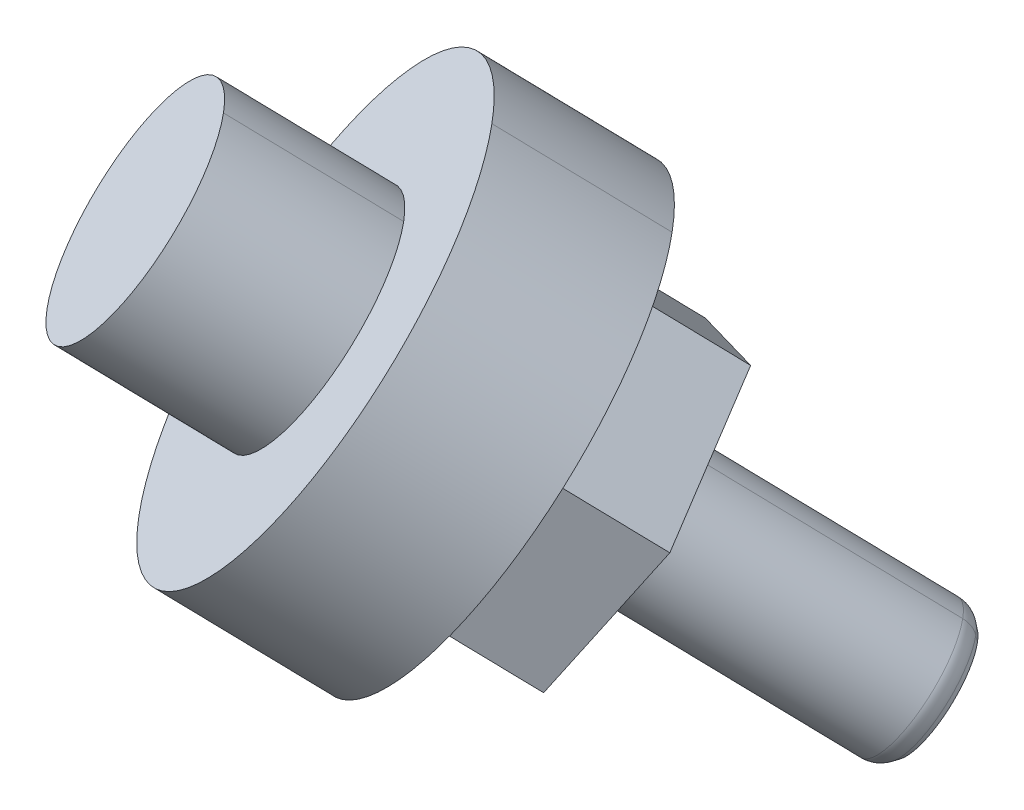
ISO-10303-21;
HEADER;
FILE_DESCRIPTION(('STEP AP214'),'2;1');
FILE_NAME('part.step','',(''),(''),'','','');
FILE_SCHEMA(('AUTOMOTIVE_DESIGN { 1 0 10303 214 1 1 1 1 }'));
ENDSEC;
DATA;
#1=APPLICATION_CONTEXT('core data for automotive mechanical design processes');
#2=APPLICATION_PROTOCOL_DEFINITION('international standard','automotive_design',2000,#1);
#3=PRODUCT_CONTEXT('',#1,'mechanical');
#4=PRODUCT('Part','Part','',(#3));
#5=PRODUCT_RELATED_PRODUCT_CATEGORY('part','',(#4));
#6=PRODUCT_DEFINITION_FORMATION('','',#4);
#7=PRODUCT_DEFINITION_CONTEXT('part definition',#1,'design');
#8=PRODUCT_DEFINITION('design','',#6,#7);
#9=PRODUCT_DEFINITION_SHAPE('','',#8);
#10=(LENGTH_UNIT() NAMED_UNIT(*) SI_UNIT(.MILLI.,.METRE.));
#11=(NAMED_UNIT(*) PLANE_ANGLE_UNIT() SI_UNIT($,.RADIAN.));
#12=(NAMED_UNIT(*) SI_UNIT($,.STERADIAN.) SOLID_ANGLE_UNIT());
#13=UNCERTAINTY_MEASURE_WITH_UNIT(LENGTH_MEASURE(1.E-05),#10,'distance_accuracy_value','');
#14=(GEOMETRIC_REPRESENTATION_CONTEXT(3) GLOBAL_UNCERTAINTY_ASSIGNED_CONTEXT((#13)) GLOBAL_UNIT_ASSIGNED_CONTEXT((#10,
#11,#12)) REPRESENTATION_CONTEXT('',''));
#15=CARTESIAN_POINT('',(0.,0.,0.));
#16=DIRECTION('',(0.,0.,1.));
#17=DIRECTION('',(1.,0.,0.));
#18=AXIS2_PLACEMENT_3D('',#15,#16,#17);
#19=CARTESIAN_POINT('',(10.8878978755803,142.293178335377,-127.729289276092));
#20=DIRECTION('',(0.61920209785537,-0.567677192432231,-0.542523149002666));
#21=DIRECTION('',(0.456004118234116,0.822428391633827,-0.340105549481515));
#22=AXIS2_PLACEMENT_3D('',#19,#20,#21);
#23=PLANE('',#22);
#24=CARTESIAN_POINT('',(10.8878978755803,142.293178335377,-127.729289276092));
#25=DIRECTION('',(0.61920209785537,-0.567677192432231,-0.542523149002666));
#26=DIRECTION('',(-0.596988629335281,0.108485304213333,-0.794880818245177));
#27=AXIS2_PLACEMENT_3D('',#24,#25,#26);
#28=CIRCLE('',#27,10.0000000003);
#29=CARTESIAN_POINT('',(4.91801158228085,143.378031377943,-135.678097458963));
#30=VERTEX_POINT('',#29);
#31=CARTESIAN_POINT('',(15.4479390580716,150.517462252076,-131.130344770909));
#32=VERTEX_POINT('',#31);
#33=EDGE_CURVE('E11',#30,#32,#28,.T.);
#34=ORIENTED_EDGE('',*,*,#33,.T.);
#35=CARTESIAN_POINT('',(10.8878978755803,142.293178335377,-127.729289276092));
#36=DIRECTION('',(0.61920209785537,-0.567677192432231,-0.542523149002666));
#37=DIRECTION('',(-0.596988629335281,0.108485304213333,-0.794880818245177));
#38=AXIS2_PLACEMENT_3D('',#35,#36,#37);
#39=CIRCLE('',#38,10.0000000003);
#40=CARTESIAN_POINT('',(16.8577841688587,141.208325292647,-119.780481093335));
#41=VERTEX_POINT('',#40);
#42=EDGE_CURVE('E27',#32,#41,#39,.T.);
#43=ORIENTED_EDGE('',*,*,#42,.T.);
#44=CARTESIAN_POINT('',(10.8878978755803,142.293178335377,-127.729289276092));
#45=DIRECTION('',(0.61920209785537,-0.567677192432231,-0.542523149002666));
#46=DIRECTION('',(-0.596988629335281,0.108485304213333,-0.794880818245177));
#47=AXIS2_PLACEMENT_3D('',#44,#45,#46);
#48=CIRCLE('',#47,10.0000000003);
#49=CARTESIAN_POINT('',(6.32785669309949,134.068894418759,-124.328233781217));
#50=VERTEX_POINT('',#49);
#51=EDGE_CURVE('E340',#41,#50,#48,.T.);
#52=ORIENTED_EDGE('',*,*,#51,.T.);
#53=CARTESIAN_POINT('',(10.8878978755803,142.293178335377,-127.729289276092));
#54=DIRECTION('',(0.61920209785537,-0.567677192432231,-0.542523149002666));
#55=DIRECTION('',(-0.596988629335281,0.108485304213333,-0.794880818245177));
#56=AXIS2_PLACEMENT_3D('',#53,#54,#55);
#57=CIRCLE('',#56,10.0000000003);
#58=EDGE_CURVE('E337',#50,#30,#57,.T.);
#59=ORIENTED_EDGE('',*,*,#58,.T.);
#60=EDGE_LOOP('',(#34,#43,#52,#59));
#61=FACE_BOUND('',#60,.T.);
#62=DIRECTION('',(-0.781614517984955,-0.379345568993508,-0.495152183232729));
#63=VECTOR('',#62,1.);
#64=CARTESIAN_POINT('',(11.3543618797028,146.820355218604,-131.933975429617));
#65=LINE('',#64,#63);
#66=CARTESIAN_POINT('',(14.1504707857522,148.177407191682,-130.162642633904));
#67=VERTEX_POINT('',#66);
#68=CARTESIAN_POINT('',(8.55825297354791,145.463303244714,-133.705308225904));
#69=VERTEX_POINT('',#68);
#70=EDGE_CURVE('E334',#67,#69,#65,.T.);
#71=ORIENTED_EDGE('',*,*,#70,.T.);
#72=DIRECTION('',(-0.456004118233701,-0.822428391634207,0.340105549481152));
#73=VECTOR('',#72,1.);
#74=CARTESIAN_POINT('',(6.92696651808229,142.521188816152,-132.488631546349));
#75=LINE('',#74,#73);
#76=CARTESIAN_POINT('',(5.29568006262894,139.579074387309,-131.271954867095));
#77=VERTEX_POINT('',#76);
#78=EDGE_CURVE('E331',#69,#77,#75,.T.);
#79=ORIENTED_EDGE('',*,*,#78,.T.);
#80=DIRECTION('',(0.3256103998447,-0.443082822472481,0.835257732644717));
#81=VECTOR('',#80,1.);
#82=CARTESIAN_POINT('',(6.46050251400198,137.99401193325,-128.283945392594));
#83=LINE('',#82,#81);
#84=CARTESIAN_POINT('',(7.62532496550214,136.408949479114,-125.295935918182));
#85=VERTEX_POINT('',#84);
#86=EDGE_CURVE('E328',#77,#85,#83,.T.);
#87=ORIENTED_EDGE('',*,*,#86,.T.);
#88=DIRECTION('',(0.781614517984955,0.379345568993508,0.495152183232729));
#89=VECTOR('',#88,1.);
#90=CARTESIAN_POINT('',(10.421433871541,137.766001452111,-123.524603122527));
#91=LINE('',#90,#89);
#92=CARTESIAN_POINT('',(13.2175427775905,139.123053425189,-121.753270326814));
#93=VERTEX_POINT('',#92);
#94=EDGE_CURVE('E325',#85,#93,#91,.T.);
#95=ORIENTED_EDGE('',*,*,#94,.T.);
#96=DIRECTION('',(0.456004118233701,0.822428391634207,-0.340105549481152));
#97=VECTOR('',#96,1.);
#98=CARTESIAN_POINT('',(14.8488292331071,142.065167854519,-122.969947005723));
#99=LINE('',#98,#97);
#100=CARTESIAN_POINT('',(16.4801156885727,145.007282283081,-124.186623685278));
#101=VERTEX_POINT('',#100);
#102=EDGE_CURVE('E322',#93,#101,#99,.T.);
#103=ORIENTED_EDGE('',*,*,#102,.T.);
#104=DIRECTION('',(-0.3256103998447,0.443082822472481,-0.835257732644717));
#105=VECTOR('',#104,1.);
#106=CARTESIAN_POINT('',(15.3152932371463,146.592344737785,-127.174633159288));
#107=LINE('',#106,#105);
#108=EDGE_CURVE('E320',#101,#67,#107,.T.);
#109=ORIENTED_EDGE('',*,*,#108,.T.);
#110=EDGE_LOOP('',(#71,#79,#87,#95,#103,#109));
#111=FACE_BOUND('',#110,.T.);
#112=ADVANCED_FACE('F17',(#61,#111),#23,.T.);
#113=CARTESIAN_POINT('',(6.55348319054595,146.266918682153,-123.931627233247));
#114=DIRECTION('',(0.61920209785537,-0.567677192432231,-0.542523149002666));
#115=DIRECTION('',(0.732561464118193,0.16884330956625,0.659428266078825));
#116=AXIS2_PLACEMENT_3D('',#113,#114,#115);
#117=CYLINDRICAL_SURFACE('',#116,10.);
#118=DIRECTION('',(0.61920209785537,-0.567677192432231,-0.542523149002666));
#119=VECTOR('',#118,1.);
#120=CARTESIAN_POINT('',(11.1135243724836,154.491202599041,-127.332682728231));
#121=LINE('',#120,#119);
#122=CARTESIAN_POINT('',(11.1135243729571,154.491202598682,-127.33268272781));
#123=VERTEX_POINT('',#122);
#124=EDGE_CURVE('E317',#123,#32,#121,.T.);
#125=ORIENTED_EDGE('',*,*,#124,.T.);
#126=ORIENTED_EDGE('',*,*,#33,.F.);
#127=ORIENTED_EDGE('',*,*,#58,.F.);
#128=DIRECTION('',(-0.61920209785537,0.567677192432231,0.542523149002666));
#129=VECTOR('',#128,1.);
#130=CARTESIAN_POINT('',(1.99344200824018,138.042634766436,-120.53057173811));
#131=LINE('',#130,#129);
#132=CARTESIAN_POINT('',(1.99344200826894,138.042634766354,-120.530571737999));
#133=VERTEX_POINT('',#132);
#134=EDGE_CURVE('E314',#50,#133,#131,.T.);
#135=ORIENTED_EDGE('',*,*,#134,.T.);
#136=CARTESIAN_POINT('',(6.55348319054595,146.266918682153,-123.931627233247));
#137=DIRECTION('',(0.61920209785537,-0.567677192432231,-0.542523149002666));
#138=DIRECTION('',(-0.59698862933528,0.108485304213335,-0.794880818245178));
#139=AXIS2_PLACEMENT_3D('',#136,#137,#138);
#140=CIRCLE('',#139,10.);
#141=CARTESIAN_POINT('',(0.583596897244921,147.351771724548,-131.880435415527));
#142=VERTEX_POINT('',#141);
#143=EDGE_CURVE('E312',#133,#142,#140,.T.);
#144=ORIENTED_EDGE('',*,*,#143,.T.);
#145=CARTESIAN_POINT('',(6.55348319054595,146.266918682153,-123.931627233247));
#146=DIRECTION('',(0.61920209785537,-0.567677192432231,-0.542523149002666));
#147=DIRECTION('',(-0.59698862933528,0.108485304213335,-0.794880818245178));
#148=AXIS2_PLACEMENT_3D('',#145,#146,#147);
#149=CIRCLE('',#148,10.);
#150=EDGE_CURVE('E310',#142,#123,#149,.T.);
#151=ORIENTED_EDGE('',*,*,#150,.T.);
#152=EDGE_LOOP('',(#125,#126,#127,#135,#144,#151));
#153=FACE_BOUND('',#152,.T.);
#154=ADVANCED_FACE('F350',(#153),#117,.T.);
#155=CARTESIAN_POINT('',(6.55348319054595,146.266918682153,-123.931627233247));
#156=DIRECTION('',(0.61920209785537,-0.567677192432231,-0.542523149002666));
#157=DIRECTION('',(0.732561464118193,0.16884330956625,0.659428266078825));
#158=AXIS2_PLACEMENT_3D('',#155,#156,#157);
#159=CYLINDRICAL_SURFACE('',#158,10.);
#160=ORIENTED_EDGE('',*,*,#134,.F.);
#161=ORIENTED_EDGE('',*,*,#51,.F.);
#162=ORIENTED_EDGE('',*,*,#42,.F.);
#163=ORIENTED_EDGE('',*,*,#124,.F.);
#164=CARTESIAN_POINT('',(6.55348319054595,146.266918682153,-123.931627233247));
#165=DIRECTION('',(0.61920209785537,-0.567677192432231,-0.542523149002666));
#166=DIRECTION('',(-0.59698862933528,0.108485304213335,-0.794880818245178));
#167=AXIS2_PLACEMENT_3D('',#164,#165,#166);
#168=CIRCLE('',#167,10.);
#169=CARTESIAN_POINT('',(12.5233694840356,145.182065640532,-115.982819050354));
#170=VERTEX_POINT('',#169);
#171=EDGE_CURVE('E308',#123,#170,#168,.T.);
#172=ORIENTED_EDGE('',*,*,#171,.T.);
#173=CARTESIAN_POINT('',(6.55348319054595,146.266918682153,-123.931627233247));
#174=DIRECTION('',(0.61920209785537,-0.567677192432231,-0.542523149002666));
#175=DIRECTION('',(-0.59698862933528,0.108485304213335,-0.794880818245178));
#176=AXIS2_PLACEMENT_3D('',#173,#174,#175);
#177=CIRCLE('',#176,10.);
#178=EDGE_CURVE('E303',#170,#133,#177,.T.);
#179=ORIENTED_EDGE('',*,*,#178,.T.);
#180=EDGE_LOOP('',(#160,#161,#162,#163,#172,#179));
#181=FACE_BOUND('',#180,.T.);
#182=ADVANCED_FACE('F347',(#181),#159,.T.);
#183=CARTESIAN_POINT('',(16.7952159227648,145.120005963361,-133.161134625099));
#184=DIRECTION('',(0.07528284846151,0.730643240174477,-0.678596307324806));
#185=DIRECTION('',(0.781614517993786,0.379345569079388,0.495152183152994));
#186=AXIS2_PLACEMENT_3D('',#183,#184,#185);
#187=PLANE('',#186);
#188=ORIENTED_EDGE('',*,*,#70,.F.);
#189=DIRECTION('',(-0.61920209785537,0.567677192432231,0.542523149002666));
#190=VECTOR('',#189,1.);
#191=CARTESIAN_POINT('',(15.6984760311261,146.758214211339,-131.518950505906));
#192=LINE('',#191,#190);
#193=CARTESIAN_POINT('',(17.2464812748745,145.339021230033,-132.875258379729));
#194=VERTEX_POINT('',#193);
#195=EDGE_CURVE('E235',#194,#67,#192,.T.);
#196=ORIENTED_EDGE('',*,*,#195,.F.);
#197=DIRECTION('',(-0.781614517993844,-0.379345569079939,-0.495152183152481));
#198=VECTOR('',#197,1.);
#199=CARTESIAN_POINT('',(14.4503723687798,143.981969256286,-134.646591174488));
#200=LINE('',#199,#198);
#201=CARTESIAN_POINT('',(11.6542634627578,142.624917282972,-136.417923970742));
#202=VERTEX_POINT('',#201);
#203=EDGE_CURVE('E300',#194,#202,#200,.T.);
#204=ORIENTED_EDGE('',*,*,#203,.T.);
#205=DIRECTION('',(-0.61920209785537,0.567677192432231,0.542523149002666));
#206=VECTOR('',#205,1.);
#207=CARTESIAN_POINT('',(10.1062582171421,144.044110262651,-135.061616098629));
#208=LINE('',#207,#206);
#209=EDGE_CURVE('E297',#202,#69,#208,.T.);
#210=ORIENTED_EDGE('',*,*,#209,.T.);
#211=EDGE_LOOP('',(#188,#196,#204,#210));
#212=FACE_BOUND('',#211,.T.);
#213=ADVANCED_FACE('F395',(#212),#187,.T.);
#214=CARTESIAN_POINT('',(11.3909893620368,142.15008802899,-136.221563939895));
#215=DIRECTION('',(-0.63925660431874,0.0367987204518855,-0.768112523012076));
#216=DIRECTION('',(0.456004118233944,0.822428391634193,-0.34010554948086));
#217=AXIS2_PLACEMENT_3D('',#214,#215,#216);
#218=PLANE('',#217);
#219=ORIENTED_EDGE('',*,*,#78,.F.);
#220=ORIENTED_EDGE('',*,*,#209,.F.);
#221=DIRECTION('',(-0.456004118233701,-0.822428391634207,0.340105549481152));
#222=VECTOR('',#221,1.);
#223=CARTESIAN_POINT('',(10.0229770072395,139.682802854004,-135.201247291474));
#224=LINE('',#223,#222);
#225=CARTESIAN_POINT('',(8.3916905517861,136.740688425161,-133.98457061222));
#226=VERTEX_POINT('',#225);
#227=EDGE_CURVE('E294',#202,#226,#224,.T.);
#228=ORIENTED_EDGE('',*,*,#227,.T.);
#229=DIRECTION('',(-0.61920209785537,0.567677192432231,0.542523149002666));
#230=VECTOR('',#229,1.);
#231=CARTESIAN_POINT('',(6.84368530715153,138.159881406295,-132.628262739733));
#232=LINE('',#231,#230);
#233=EDGE_CURVE('E291',#226,#77,#232,.T.);
#234=ORIENTED_EDGE('',*,*,#233,.T.);
#235=EDGE_LOOP('',(#219,#220,#228,#234));
#236=FACE_BOUND('',#235,.T.);
#237=ADVANCED_FACE('F398',(#236),#218,.T.);
#238=CARTESIAN_POINT('',(8.57968180415307,136.48487443898,-133.502334335691));
#239=DIRECTION('',(-0.714539452780055,-0.693844519723227,-0.0895162156864598));
#240=DIRECTION('',(-0.325610399760712,0.443082822554256,-0.835257732634079));
#241=AXIS2_PLACEMENT_3D('',#238,#239,#240);
#242=PLANE('',#241);
#243=ORIENTED_EDGE('',*,*,#86,.F.);
#244=ORIENTED_EDGE('',*,*,#233,.F.);
#245=DIRECTION('',(0.325610399760124,-0.443082822554828,0.835257732634005));
#246=VECTOR('',#245,1.);
#247=CARTESIAN_POINT('',(9.5565130034268,135.155625971356,-130.99656113778));
#248=LINE('',#247,#246);
#249=CARTESIAN_POINT('',(10.7213354549543,133.570563516432,-128.008551662431));
#250=VERTEX_POINT('',#249);
#251=EDGE_CURVE('E288',#226,#250,#248,.T.);
#252=ORIENTED_EDGE('',*,*,#251,.T.);
#253=DIRECTION('',(-0.61920209785537,0.567677192432231,0.542523149002666));
#254=VECTOR('',#253,1.);
#255=CARTESIAN_POINT('',(9.17333021025476,134.989756497441,-126.65224378993));
#256=LINE('',#255,#254);
#257=EDGE_CURVE('E285',#250,#85,#256,.T.);
#258=ORIENTED_EDGE('',*,*,#257,.T.);
#259=EDGE_LOOP('',(#243,#244,#252,#258));
#260=FACE_BOUND('',#259,.T.);
#261=ADVANCED_FACE('F402',(#260),#242,.T.);
#262=CARTESIAN_POINT('',(11.1726008070307,133.789578783223,-127.722675416876));
#263=DIRECTION('',(-0.07528284846151,-0.730643240174477,0.678596307324806));
#264=DIRECTION('',(-0.781614517993786,-0.379345569079388,-0.495152183152994));
#265=AXIS2_PLACEMENT_3D('',#262,#263,#264);
#266=PLANE('',#265);
#267=ORIENTED_EDGE('',*,*,#94,.F.);
#268=ORIENTED_EDGE('',*,*,#257,.F.);
#269=DIRECTION('',(0.781614517993844,0.379345569079939,0.495152183152481));
#270=VECTOR('',#269,1.);
#271=CARTESIAN_POINT('',(13.517444360943,134.927615490417,-126.237218867469));
#272=LINE('',#271,#270);
#273=CARTESIAN_POINT('',(16.3135532679766,136.284667464742,-124.465886071087));
#274=VERTEX_POINT('',#273);
#275=EDGE_CURVE('E282',#250,#274,#272,.T.);
#276=ORIENTED_EDGE('',*,*,#275,.T.);
#277=DIRECTION('',(-0.61920209785537,0.567677192432231,0.542523149002666));
#278=VECTOR('',#277,1.);
#279=CARTESIAN_POINT('',(14.7655480234253,137.703860445838,-123.10957819856));
#280=LINE('',#279,#278);
#281=EDGE_CURVE('E279',#274,#93,#280,.T.);
#282=ORIENTED_EDGE('',*,*,#281,.T.);
#283=EDGE_LOOP('',(#267,#268,#276,#282));
#284=FACE_BOUND('',#283,.T.);
#285=ADVANCED_FACE('F406',(#284),#266,.T.);
#286=CARTESIAN_POINT('',(16.5768273677394,136.759496717068,-124.662246102552));
#287=DIRECTION('',(0.63925660431874,-0.0367987204518855,0.768112523012076));
#288=DIRECTION('',(-0.456004118233944,-0.822428391634193,0.34010554948086));
#289=AXIS2_PLACEMENT_3D('',#286,#287,#288);
#290=PLANE('',#289);
#291=ORIENTED_EDGE('',*,*,#102,.F.);
#292=ORIENTED_EDGE('',*,*,#281,.F.);
#293=DIRECTION('',(0.456004118233701,0.822428391634207,-0.340105549481152));
#294=VECTOR('',#293,1.);
#295=CARTESIAN_POINT('',(17.9448397224307,139.226781892293,-125.68256275077));
#296=LINE('',#295,#294);
#297=CARTESIAN_POINT('',(19.5761261778418,142.168896320812,-126.899239430253));
#298=VERTEX_POINT('',#297);
#299=EDGE_CURVE('E276',#274,#298,#296,.T.);
#300=ORIENTED_EDGE('',*,*,#299,.T.);
#301=DIRECTION('',(-0.61920209785537,0.567677192432231,0.542523149002666));
#302=VECTOR('',#301,1.);
#303=CARTESIAN_POINT('',(18.0281209332905,143.588089301908,-125.542931557726));
#304=LINE('',#303,#302);
#305=EDGE_CURVE('E273',#298,#101,#304,.T.);
#306=ORIENTED_EDGE('',*,*,#305,.T.);
#307=EDGE_LOOP('',(#291,#292,#300,#306));
#308=FACE_BOUND('',#307,.T.);
#309=ADVANCED_FACE('F410',(#308),#290,.T.);
#310=CARTESIAN_POINT('',(19.3881349256003,142.424710307278,-127.381475706513));
#311=DIRECTION('',(0.714539452780055,0.693844519723227,0.0895162156864598));
#312=DIRECTION('',(0.325610399760712,-0.443082822554256,0.835257732634079));
#313=AXIS2_PLACEMENT_3D('',#310,#311,#312);
#314=PLANE('',#313);
#315=ORIENTED_EDGE('',*,*,#108,.F.);
#316=ORIENTED_EDGE('',*,*,#305,.F.);
#317=DIRECTION('',(-0.325610399760124,0.443082822554828,-0.835257732634005));
#318=VECTOR('',#317,1.);
#319=CARTESIAN_POINT('',(18.4113037263898,143.75395877539,-129.88724890408));
#320=LINE('',#319,#318);
#321=EDGE_CURVE('E270',#298,#194,#320,.T.);
#322=ORIENTED_EDGE('',*,*,#321,.T.);
#323=ORIENTED_EDGE('',*,*,#195,.T.);
#324=EDGE_LOOP('',(#315,#316,#322,#323));
#325=FACE_BOUND('',#324,.T.);
#326=ADVANCED_FACE('F358',(#325),#314,.T.);
#327=CARTESIAN_POINT('',(6.55348319054595,146.266918682153,-123.931627233247));
#328=DIRECTION('',(-0.61920209785537,0.567677192432231,0.542523149002666));
#329=DIRECTION('',(-0.456004118234116,-0.822428391633827,0.340105549481515));
#330=AXIS2_PLACEMENT_3D('',#327,#328,#329);
#331=PLANE('',#330);
#332=ORIENTED_EDGE('',*,*,#143,.F.);
#333=ORIENTED_EDGE('',*,*,#178,.F.);
#334=ORIENTED_EDGE('',*,*,#171,.F.);
#335=ORIENTED_EDGE('',*,*,#150,.F.);
#336=EDGE_LOOP('',(#332,#333,#334,#335));
#337=FACE_BOUND('',#336,.T.);
#338=CARTESIAN_POINT('',(6.55348319054595,146.266918682153,-123.931627233247));
#339=DIRECTION('',(-0.61920209785537,0.567677192432231,0.542523149002666));
#340=DIRECTION('',(-0.596988629335281,0.108485304213333,-0.794880818245177));
#341=AXIS2_PLACEMENT_3D('',#338,#339,#340);
#342=CIRCLE('',#341,5.00000000016);
#343=CARTESIAN_POINT('',(8.83350378178988,150.379060640865,-125.632154980297));
#344=VERTEX_POINT('',#343);
#345=CARTESIAN_POINT('',(3.56854004394815,146.809345203757,-127.9060313241));
#346=VERTEX_POINT('',#345);
#347=EDGE_CURVE('E228',#344,#346,#342,.T.);
#348=ORIENTED_EDGE('',*,*,#347,.F.);
#349=CARTESIAN_POINT('',(6.55348319054595,146.266918682153,-123.931627233247));
#350=DIRECTION('',(-0.61920209785537,0.567677192432231,0.542523149002666));
#351=DIRECTION('',(-0.596988629335281,0.108485304213333,-0.794880818245177));
#352=AXIS2_PLACEMENT_3D('',#349,#350,#351);
#353=CIRCLE('',#352,5.00000000016);
#354=CARTESIAN_POINT('',(9.53842633724918,145.724492161362,-119.95722314182));
#355=VERTEX_POINT('',#354);
#356=EDGE_CURVE('E216',#355,#344,#353,.T.);
#357=ORIENTED_EDGE('',*,*,#356,.F.);
#358=CARTESIAN_POINT('',(6.55348319054595,146.266918682153,-123.931627233247));
#359=DIRECTION('',(-0.61920209785537,0.567677192432231,0.542523149002666));
#360=DIRECTION('',(-0.596988629335281,0.108485304213333,-0.794880818245177));
#361=AXIS2_PLACEMENT_3D('',#358,#359,#360);
#362=CIRCLE('',#361,5.00000000016);
#363=CARTESIAN_POINT('',(4.27346259940743,142.154776724253,-122.231099485623));
#364=VERTEX_POINT('',#363);
#365=EDGE_CURVE('E265',#364,#355,#362,.T.);
#366=ORIENTED_EDGE('',*,*,#365,.F.);
#367=CARTESIAN_POINT('',(6.55348319054595,146.266918682153,-123.931627233247));
#368=DIRECTION('',(-0.61920209785537,0.567677192432231,0.542523149002666));
#369=DIRECTION('',(-0.596988629335281,0.108485304213333,-0.794880818245177));
#370=AXIS2_PLACEMENT_3D('',#367,#368,#369);
#371=CIRCLE('',#370,5.00000000016);
#372=EDGE_CURVE('E259',#346,#364,#371,.T.);
#373=ORIENTED_EDGE('',*,*,#372,.F.);
#374=EDGE_LOOP('',(#348,#357,#366,#373));
#375=FACE_BOUND('',#374,.T.);
#376=ADVANCED_FACE('F354',(#337,#375),#331,.T.);
#377=CARTESIAN_POINT('',(6.55819654754959,132.244148608914,-131.372184823122));
#378=DIRECTION('',(-0.61920209785537,0.567677192432231,0.542523149002666));
#379=DIRECTION('',(-0.456004118234116,-0.822428391633827,0.340105549481515));
#380=AXIS2_PLACEMENT_3D('',#377,#378,#379);
#381=PLANE('',#380);
#382=ORIENTED_EDGE('',*,*,#227,.F.);
#383=ORIENTED_EDGE('',*,*,#203,.F.);
#384=ORIENTED_EDGE('',*,*,#321,.F.);
#385=ORIENTED_EDGE('',*,*,#299,.F.);
#386=ORIENTED_EDGE('',*,*,#275,.F.);
#387=ORIENTED_EDGE('',*,*,#251,.F.);
#388=EDGE_LOOP('',(#382,#383,#384,#385,#386,#387));
#389=FACE_BOUND('',#388,.T.);
#390=CARTESIAN_POINT('',(12.6158974380324,136.987509773595,-129.421589437648));
#391=CARTESIAN_POINT('',(12.533927655861,136.9922277221,-129.520081332343));
#392=CARTESIAN_POINT('',(12.4550821470636,137.002579604603,-129.620902527166));
#393=CARTESIAN_POINT('',(12.3796734289436,137.018547663649,-129.723677753309));
#394=CARTESIAN_POINT('',(12.1182438874742,137.097045006351,-130.104193998639));
#395=CARTESIAN_POINT('',(11.9097714179256,137.248061714373,-130.500150063763));
#396=CARTESIAN_POINT('',(11.7911365616213,137.39399261541,-130.788249468058));
#397=CARTESIAN_POINT('',(11.6257510347448,137.75046488781,-131.350010278709));
#398=CARTESIAN_POINT('',(11.6089058193279,138.214291173212,-131.854567912319));
#399=CARTESIAN_POINT('',(11.6388474584816,138.467603950555,-132.085451996542));
#400=CARTESIAN_POINT('',(11.7436886757755,138.883565214025,-132.401040042663));
#401=CARTESIAN_POINT('',(11.932534941888,139.316694910089,-132.638714408892));
#402=CARTESIAN_POINT('',(12.0100332549713,139.471974040516,-132.712741301402));
#403=CARTESIAN_POINT('',(12.0970968072849,139.626909189377,-132.775491095706));
#404=CARTESIAN_POINT('',(12.1929424776455,139.780248286269,-132.826547475302));
#405=B_SPLINE_CURVE_WITH_KNOTS('',5,(#390,#391,#392,#393,#394,#395,#396,#397,#398,#399,#400,
#401,#402,#403,#404),.UNSPECIFIED.,.F.,.F.,(6,3,3,3,6),(0.,0.12887556224128,0.470009680849398,
0.811143799301159,1.),.UNSPECIFIED.);
#406=CARTESIAN_POINT('',(12.6158960101171,136.987507198246,-129.421588372659));
#407=VERTEX_POINT('',#406);
#408=CARTESIAN_POINT('',(12.1929424768698,139.780248285804,-132.826547475895));
#409=VERTEX_POINT('',#408);
#410=EDGE_CURVE('E208',#407,#409,#405,.T.);
#411=ORIENTED_EDGE('',*,*,#410,.F.);
#412=CARTESIAN_POINT('',(15.7748742531106,139.129336460004,-128.057262565713));
#413=CARTESIAN_POINT('',(15.6017466141835,138.85235748234,-127.965038572412));
#414=CARTESIAN_POINT('',(15.3999648548142,138.58058607124,-127.910967620426));
#415=CARTESIAN_POINT('',(15.1741176486297,138.321388212639,-127.897519994333));
#416=CARTESIAN_POINT('',(14.6867284808798,137.842413721227,-127.952613496773));
#417=CARTESIAN_POINT('',(14.1550704405914,137.465004147775,-128.164506698133));
#418=CARTESIAN_POINT('',(13.8849416527394,137.307394637294,-128.307897791945));
#419=CARTESIAN_POINT('',(13.4518252464957,137.109202250857,-128.594848293719));
#420=CARTESIAN_POINT('',(13.0449397817243,137.010125868361,-128.955571944196));
#421=CARTESIAN_POINT('',(12.8943815167134,136.987251547015,-129.103474873438));
#422=CARTESIAN_POINT('',(12.7509019911651,136.979739293834,-129.259372900329));
#423=CARTESIAN_POINT('',(12.6158974380324,136.987509773595,-129.421589437648));
#424=B_SPLINE_CURVE_WITH_KNOTS('',5,(#412,#413,#414,#415,#416,#417,#418,#419,#420,#421,#422,
#423),.UNSPECIFIED.,.F.,.F.,(6,3,3,6),(0.,0.381357070556463,0.762714142304688,1.),.UNSPECIFIED.);
#425=CARTESIAN_POINT('',(15.7748742528548,139.129336460537,-128.05726256642));
#426=VERTEX_POINT('',#425);
#427=EDGE_CURVE('E232',#426,#407,#424,.T.);
#428=ORIENTED_EDGE('',*,*,#427,.F.);
#429=CARTESIAN_POINT('',(15.3519192916605,141.922074972502,-131.462220604839));
#430=CARTESIAN_POINT('',(15.4338890737382,141.917357023955,-131.363728710242));
#431=CARTESIAN_POINT('',(15.5127345824553,141.907005141817,-131.262907515397));
#432=CARTESIAN_POINT('',(15.5881433005419,141.891037082889,-131.160132289068));
#433=CARTESIAN_POINT('',(15.8495728423319,141.812539740313,-130.779616043278));
#434=CARTESIAN_POINT('',(16.0580453120892,141.661523032005,-130.383659977612));
#435=CARTESIAN_POINT('',(16.1766801677117,141.515592131097,-130.095560575291));
#436=CARTESIAN_POINT('',(16.342065695069,141.15911985861,-129.533799763212));
#437=CARTESIAN_POINT('',(16.3589109102999,140.695293572209,-129.029242128676));
#438=CARTESIAN_POINT('',(16.328969271403,140.441980797194,-128.798358046749));
#439=CARTESIAN_POINT('',(16.2241280550131,140.02601953644,-128.482770002894));
#440=CARTESIAN_POINT('',(16.0352817909505,139.592889843763,-128.245095637652));
#441=CARTESIAN_POINT('',(15.9577834715925,139.437610698025,-128.171068736617));
#442=CARTESIAN_POINT('',(15.8707199211698,139.282675553453,-128.108318943848));
#443=CARTESIAN_POINT('',(15.7748742531106,139.129336460004,-128.057262565713));
#444=B_SPLINE_CURVE_WITH_KNOTS('',5,(#429,#430,#431,#432,#433,#434,#435,#436,#437,#438,#439,
#440,#441,#442,#443),.UNSPECIFIED.,.F.,.F.,(6,3,3,3,6),(0.,0.128875562760927,0.470009682919141,
0.811143803260718,1.),.UNSPECIFIED.);
#445=CARTESIAN_POINT('',(15.3519207195952,141.922077548376,-131.462221669355));
#446=VERTEX_POINT('',#445);
#447=EDGE_CURVE('E201',#446,#426,#444,.T.);
#448=ORIENTED_EDGE('',*,*,#447,.F.);
#449=CARTESIAN_POINT('',(12.1929424776455,139.780248286269,-132.826547475302));
#450=CARTESIAN_POINT('',(12.3660701176897,140.057227265773,-132.918771469147));
#451=CARTESIAN_POINT('',(12.5678518787389,140.328998678967,-132.972842421094));
#452=CARTESIAN_POINT('',(12.7936990775945,140.588196530251,-132.986290048555));
#453=CARTESIAN_POINT('',(13.2810882479782,141.067171024933,-132.931196546171));
#454=CARTESIAN_POINT('',(13.8127462913107,141.444580600256,-132.719303343314));
#455=CARTESIAN_POINT('',(14.0828750756772,141.602190107865,-132.575912250548));
#456=CARTESIAN_POINT('',(14.5159914832396,141.80038249503,-132.288961748306));
#457=CARTESIAN_POINT('',(14.9228769492297,141.899458878077,-131.928238096567));
#458=CARTESIAN_POINT('',(15.0734352137221,141.922333199131,-131.780335168036));
#459=CARTESIAN_POINT('',(15.2169147389106,141.929845452188,-131.624437141774));
#460=CARTESIAN_POINT('',(15.3519192916605,141.922074972502,-131.462220604839));
#461=B_SPLINE_CURVE_WITH_KNOTS('',5,(#449,#450,#451,#452,#453,#454,#455,#456,#457,#458,#459,
#460),.UNSPECIFIED.,.F.,.F.,(6,3,3,6),(0.,0.381357071502582,0.762714143240339,1.),.UNSPECIFIED.);
#462=EDGE_CURVE('E203',#409,#446,#461,.T.);
#463=ORIENTED_EDGE('',*,*,#462,.F.);
#464=EDGE_LOOP('',(#411,#428,#448,#463));
#465=FACE_BOUND('',#464,.T.);
#466=ADVANCED_FACE('F357',(#389,#465),#381,.F.);
#467=CARTESIAN_POINT('',(2.21906850570022,150.240659029703,-120.133965189789));
#468=DIRECTION('',(0.61920209785537,-0.567677192432231,-0.542523149002666));
#469=DIRECTION('',(0.732561464118194,0.168843309566252,0.659428266078823));
#470=AXIS2_PLACEMENT_3D('',#467,#468,#469);
#471=CYLINDRICAL_SURFACE('',#470,5.);
#472=DIRECTION('',(-0.61920209785537,0.567677192432231,0.542523149002666));
#473=VECTOR('',#472,1.);
#474=CARTESIAN_POINT('',(-0.0609520856299769,146.128517071238,-118.433437443073));
#475=LINE('',#474,#473);
#476=CARTESIAN_POINT('',(-0.0609520855437235,146.128517070991,-118.433437442739));
#477=VERTEX_POINT('',#476);
#478=EDGE_CURVE('E227',#364,#477,#475,.T.);
#479=ORIENTED_EDGE('',*,*,#478,.T.);
#480=CARTESIAN_POINT('',(2.21906850570022,150.240659029703,-120.133965189789));
#481=DIRECTION('',(-0.61920209785537,0.567677192432231,0.542523149002666));
#482=DIRECTION('',(-0.59698862933528,0.108485304213335,-0.794880818245178));
#483=AXIS2_PLACEMENT_3D('',#480,#481,#482);
#484=CIRCLE('',#483,5.);
#485=CARTESIAN_POINT('',(-0.765874641003019,150.783085550494,-124.108369281216));
#486=VERTEX_POINT('',#485);
#487=EDGE_CURVE('E220',#486,#477,#484,.T.);
#488=ORIENTED_EDGE('',*,*,#487,.F.);
#489=CARTESIAN_POINT('',(2.21906850570022,150.240659029703,-120.133965189789));
#490=DIRECTION('',(-0.61920209785537,0.567677192432231,0.542523149002666));
#491=DIRECTION('',(-0.59698862933528,0.108485304213335,-0.794880818245178));
#492=AXIS2_PLACEMENT_3D('',#489,#490,#491);
#493=CIRCLE('',#492,5.);
#494=CARTESIAN_POINT('',(4.49908909683873,154.352800987603,-121.834492937413));
#495=VERTEX_POINT('',#494);
#496=EDGE_CURVE('E197',#495,#486,#493,.T.);
#497=ORIENTED_EDGE('',*,*,#496,.F.);
#498=DIRECTION('',(0.61920209785537,-0.567677192432231,-0.542523149002666));
#499=VECTOR('',#498,1.);
#500=CARTESIAN_POINT('',(4.49908909679038,154.352800987142,-121.834492936753));
#501=LINE('',#500,#499);
#502=EDGE_CURVE('E224',#495,#344,#501,.T.);
#503=ORIENTED_EDGE('',*,*,#502,.T.);
#504=ORIENTED_EDGE('',*,*,#347,.T.);
#505=ORIENTED_EDGE('',*,*,#372,.T.);
#506=EDGE_LOOP('',(#479,#488,#497,#503,#504,#505));
#507=FACE_BOUND('',#506,.T.);
#508=ADVANCED_FACE('F364',(#507),#471,.T.);
#509=CARTESIAN_POINT('',(2.21906850570022,150.240659029703,-120.133965189789));
#510=DIRECTION('',(0.61920209785537,-0.567677192432231,-0.542523149002666));
#511=DIRECTION('',(0.732561464118194,0.168843309566252,0.659428266078823));
#512=AXIS2_PLACEMENT_3D('',#509,#510,#511);
#513=CYLINDRICAL_SURFACE('',#512,5.);
#514=ORIENTED_EDGE('',*,*,#502,.F.);
#515=CARTESIAN_POINT('',(2.21906850570022,150.240659029703,-120.133965189789));
#516=DIRECTION('',(-0.61920209785537,0.567677192432231,0.542523149002666));
#517=DIRECTION('',(-0.59698862933528,0.108485304213335,-0.794880818245178));
#518=AXIS2_PLACEMENT_3D('',#515,#516,#517);
#519=CIRCLE('',#518,5.);
#520=CARTESIAN_POINT('',(5.20401165229803,149.698232508099,-116.159561098937));
#521=VERTEX_POINT('',#520);
#522=EDGE_CURVE('E221',#521,#495,#519,.T.);
#523=ORIENTED_EDGE('',*,*,#522,.F.);
#524=CARTESIAN_POINT('',(2.21906850570022,150.240659029703,-120.133965189789));
#525=DIRECTION('',(-0.61920209785537,0.567677192432231,0.542523149002666));
#526=DIRECTION('',(-0.59698862933528,0.108485304213335,-0.794880818245178));
#527=AXIS2_PLACEMENT_3D('',#524,#525,#526);
#528=CIRCLE('',#527,5.);
#529=EDGE_CURVE('E217',#477,#521,#528,.T.);
#530=ORIENTED_EDGE('',*,*,#529,.F.);
#531=ORIENTED_EDGE('',*,*,#478,.F.);
#532=ORIENTED_EDGE('',*,*,#365,.T.);
#533=ORIENTED_EDGE('',*,*,#356,.T.);
#534=EDGE_LOOP('',(#514,#523,#530,#531,#532,#533));
#535=FACE_BOUND('',#534,.T.);
#536=ADVANCED_FACE('F366',(#535),#513,.T.);
#537=CARTESIAN_POINT('',(13.9839083649039,139.454792373151,-130.441905021138));
#538=DIRECTION('',(0.61920209785537,-0.567677192432231,-0.542523149002666));
#539=DIRECTION('',(0.732561464118194,0.168843309566253,0.659428266078823));
#540=AXIS2_PLACEMENT_3D('',#537,#538,#539);
#541=CYLINDRICAL_SURFACE('',#540,3.);
#542=DIRECTION('',(0.61920209785537,-0.567677192432231,-0.542523149002666));
#543=VECTOR('',#542,1.);
#544=CARTESIAN_POINT('',(15.3519207195756,141.922077547833,-131.462221668584));
#545=LINE('',#544,#543);
#546=CARTESIAN_POINT('',(22.21626293824,135.628929427028,-137.47651743651));
#547=VERTEX_POINT('',#546);
#548=EDGE_CURVE('E213',#446,#547,#545,.T.);
#549=ORIENTED_EDGE('',*,*,#548,.T.);
#550=CARTESIAN_POINT('',(20.8482505834197,133.161644252372,-136.456200788416));
#551=DIRECTION('',(-0.61920209785537,0.567677192432231,0.542523149002666));
#552=DIRECTION('',(-0.732561464118194,-0.168843309566253,-0.659428266078823));
#553=AXIS2_PLACEMENT_3D('',#550,#551,#552);
#554=CIRCLE('',#553,3.);
#555=CARTESIAN_POINT('',(19.0572846953701,133.487100164988,-138.840843243121));
#556=VERTEX_POINT('',#555);
#557=EDGE_CURVE('E211',#547,#556,#554,.T.);
#558=ORIENTED_EDGE('',*,*,#557,.T.);
#559=CARTESIAN_POINT('',(20.8482505833914,133.161644252338,-136.456200788381));
#560=DIRECTION('',(-0.61920209785537,0.567677192432231,0.542523149002666));
#561=DIRECTION('',(-0.596988629335282,0.108485304213332,-0.794880818245177));
#562=AXIS2_PLACEMENT_3D('',#559,#560,#561);
#563=CIRCLE('',#562,3.);
#564=CARTESIAN_POINT('',(19.4802382287422,130.694359077438,-135.435884139935));
#565=VERTEX_POINT('',#564);
#566=EDGE_CURVE('E207',#556,#565,#563,.T.);
#567=ORIENTED_EDGE('',*,*,#566,.T.);
#568=DIRECTION('',(-0.61920209785537,0.567677192432231,0.542523149002666));
#569=VECTOR('',#568,1.);
#570=CARTESIAN_POINT('',(12.615896010577,136.987507198014,-129.42158837259));
#571=LINE('',#570,#569);
#572=EDGE_CURVE('E204',#565,#407,#571,.T.);
#573=ORIENTED_EDGE('',*,*,#572,.T.);
#574=ORIENTED_EDGE('',*,*,#410,.T.);
#575=ORIENTED_EDGE('',*,*,#462,.T.);
#576=EDGE_LOOP('',(#549,#558,#567,#573,#574,#575));
#577=FACE_BOUND('',#576,.T.);
#578=ADVANCED_FACE('F383',(#577),#541,.T.);
#579=CARTESIAN_POINT('',(13.9839083649039,139.454792373151,-130.441905021138));
#580=DIRECTION('',(0.61920209785537,-0.567677192432231,-0.542523149002666));
#581=DIRECTION('',(0.732561464118194,0.168843309566253,0.659428266078823));
#582=AXIS2_PLACEMENT_3D('',#579,#580,#581);
#583=CYLINDRICAL_SURFACE('',#582,3.);
#584=ORIENTED_EDGE('',*,*,#572,.F.);
#585=CARTESIAN_POINT('',(20.8482505833914,133.161644252338,-136.456200788381));
#586=DIRECTION('',(-0.61920209785537,0.567677192432231,0.542523149002666));
#587=DIRECTION('',(-0.596988629335282,0.108485304213332,-0.794880818245177));
#588=AXIS2_PLACEMENT_3D('',#585,#586,#587);
#589=CIRCLE('',#588,3.);
#590=CARTESIAN_POINT('',(22.6392164714385,132.836188339764,-134.071558333668));
#591=VERTEX_POINT('',#590);
#592=EDGE_CURVE('E200',#565,#591,#589,.T.);
#593=ORIENTED_EDGE('',*,*,#592,.T.);
#594=CARTESIAN_POINT('',(20.848250583447,133.161644252347,-136.45620078844));
#595=DIRECTION('',(-0.61920209785537,0.567677192432231,0.542523149002666));
#596=DIRECTION('',(-0.732561464118194,-0.168843309566253,-0.659428266078823));
#597=AXIS2_PLACEMENT_3D('',#594,#595,#596);
#598=CIRCLE('',#597,3.);
#599=EDGE_CURVE('E198',#591,#547,#598,.T.);
#600=ORIENTED_EDGE('',*,*,#599,.T.);
#601=ORIENTED_EDGE('',*,*,#548,.F.);
#602=ORIENTED_EDGE('',*,*,#447,.T.);
#603=ORIENTED_EDGE('',*,*,#427,.T.);
#604=EDGE_LOOP('',(#584,#593,#600,#601,#602,#603));
#605=FACE_BOUND('',#604,.T.);
#606=ADVANCED_FACE('F373',(#605),#583,.T.);
#607=CARTESIAN_POINT('',(2.21906850570022,150.240659029703,-120.133965189789));
#608=DIRECTION('',(-0.61920209785537,0.567677192432231,0.542523149002666));
#609=DIRECTION('',(-0.456004118234116,-0.822428391633827,0.340105549481515));
#610=AXIS2_PLACEMENT_3D('',#607,#608,#609);
#611=PLANE('',#610);
#612=ORIENTED_EDGE('',*,*,#487,.T.);
#613=ORIENTED_EDGE('',*,*,#529,.T.);
#614=ORIENTED_EDGE('',*,*,#522,.T.);
#615=ORIENTED_EDGE('',*,*,#496,.T.);
#616=EDGE_LOOP('',(#612,#613,#614,#615));
#617=FACE_BOUND('',#616,.T.);
#618=ADVANCED_FACE('F369',(#617),#611,.T.);
#619=CARTESIAN_POINT('',(20.8482505834458,133.161644252381,-136.456200788453));
#620=DIRECTION('',(0.61920209785537,-0.567677192432231,-0.542523149002666));
#621=DIRECTION('',(0.456004118234117,0.822428391633827,-0.340105549481514));
#622=AXIS2_PLACEMENT_3D('',#619,#620,#621);
#623=TOROIDAL_SURFACE('',#622,2.,1.);
#624=CARTESIAN_POINT('',(21.7602588199124,134.806501035581,-137.136411887387));
#625=DIRECTION('',(-0.63925660431874,0.0367987204518855,-0.768112523012076));
#626=DIRECTION('',(-0.548297085841562,0.678543377989168,0.488824293427301));
#627=AXIS2_PLACEMENT_3D('',#624,#625,#626);
#628=CIRCLE('',#627,1.);
#629=CARTESIAN_POINT('',(22.5205444262854,134.986637336104,-137.760524625168));
#630=VERTEX_POINT('',#629);
#631=EDGE_CURVE('E191',#547,#630,#628,.T.);
#632=ORIENTED_EDGE('',*,*,#631,.T.);
#633=CARTESIAN_POINT('',(21.2860925857574,132.760235860052,-136.839822586012));
#634=DIRECTION('',(0.61920209785537,-0.567677192432231,-0.542523149002666));
#635=DIRECTION('',(-0.59698862933528,0.108485304213336,-0.794880818245178));
#636=AXIS2_PLACEMENT_3D('',#633,#634,#635);
#637=CIRCLE('',#636,2.70710678119);
#638=CARTESIAN_POINT('',(19.669980618994,133.053917162876,-138.991649839113));
#639=VERTEX_POINT('',#638);
#640=EDGE_CURVE('E180',#639,#630,#637,.T.);
#641=ORIENTED_EDGE('',*,*,#640,.F.);
#642=CARTESIAN_POINT('',(21.2860925857574,132.760235860052,-136.839822586012));
#643=DIRECTION('',(0.61920209785537,-0.567677192432231,-0.542523149002666));
#644=DIRECTION('',(-0.59698862933528,0.108485304213336,-0.794880818245178));
#645=AXIS2_PLACEMENT_3D('',#642,#643,#644);
#646=CIRCLE('',#645,2.70710678119);
#647=CARTESIAN_POINT('',(20.0516407450401,130.533834384278,-135.919120546691));
#648=VERTEX_POINT('',#647);
#649=EDGE_CURVE('E185',#648,#639,#646,.T.);
#650=ORIENTED_EDGE('',*,*,#649,.F.);
#651=CARTESIAN_POINT('',(19.9362423469248,131.516787469138,-135.775989689448));
#652=DIRECTION('',(-0.63925660431874,0.0367987204518855,-0.768112523012076));
#653=DIRECTION('',(-0.548297085841562,0.678543377989168,0.488824293427301));
#654=AXIS2_PLACEMENT_3D('',#651,#652,#653);
#655=CIRCLE('',#654,1.);
#656=EDGE_CURVE('E184',#648,#565,#655,.T.);
#657=ORIENTED_EDGE('',*,*,#656,.T.);
#658=ORIENTED_EDGE('',*,*,#566,.F.);
#659=ORIENTED_EDGE('',*,*,#557,.F.);
#660=EDGE_LOOP('',(#632,#641,#650,#657,#658,#659));
#661=FACE_BOUND('',#660,.T.);
#662=ADVANCED_FACE('F372',(#661),#623,.T.);
#663=CARTESIAN_POINT('',(20.8482505834458,133.161644252381,-136.456200788453));
#664=DIRECTION('',(0.61920209785537,-0.567677192432231,-0.542523149002666));
#665=DIRECTION('',(-0.456004118234117,-0.822428391633827,0.340105549481514));
#666=AXIS2_PLACEMENT_3D('',#663,#664,#665);
#667=TOROIDAL_SURFACE('',#666,2.,1.);
#668=ORIENTED_EDGE('',*,*,#656,.F.);
#669=CARTESIAN_POINT('',(21.2860925857574,132.760235860052,-136.839822586012));
#670=DIRECTION('',(0.61920209785537,-0.567677192432231,-0.542523149002666));
#671=DIRECTION('',(-0.59698862933528,0.108485304213336,-0.794880818245178));
#672=AXIS2_PLACEMENT_3D('',#669,#670,#671);
#673=CIRCLE('',#672,2.70710678119);
#674=CARTESIAN_POINT('',(22.9022045523316,132.466554557506,-134.687995332746));
#675=VERTEX_POINT('',#674);
#676=EDGE_CURVE('E172',#675,#648,#673,.T.);
#677=ORIENTED_EDGE('',*,*,#676,.F.);
#678=CARTESIAN_POINT('',(21.2860925857574,132.760235860052,-136.839822586012));
#679=DIRECTION('',(0.61920209785537,-0.567677192432231,-0.542523149002666));
#680=DIRECTION('',(-0.59698862933528,0.108485304213336,-0.794880818245178));
#681=AXIS2_PLACEMENT_3D('',#678,#679,#680);
#682=CIRCLE('',#681,2.70710678119);
#683=EDGE_CURVE('E181',#630,#675,#682,.T.);
#684=ORIENTED_EDGE('',*,*,#683,.F.);
#685=ORIENTED_EDGE('',*,*,#631,.F.);
#686=ORIENTED_EDGE('',*,*,#599,.F.);
#687=ORIENTED_EDGE('',*,*,#592,.F.);
#688=EDGE_LOOP('',(#668,#677,#684,#685,#686,#687));
#689=FACE_BOUND('',#688,.T.);
#690=ADVANCED_FACE('F380',(#689),#667,.T.);
#691=CARTESIAN_POINT('',(21.4143335391031,132.642666063982,-136.952182809111));
#692=DIRECTION('',(-0.61920209785537,0.567677192432231,0.542523149002666));
#693=DIRECTION('',(0.456004118234116,0.822428391633827,-0.340105549481515));
#694=AXIS2_PLACEMENT_3D('',#691,#692,#693);
#695=CONICAL_SURFACE('',#694,2.5,0.7853981625);
#696=DIRECTION('',(-0.760285606674027,-0.18013629958929,0.62411273809672));
#697=VECTOR('',#696,1.);
#698=CARTESIAN_POINT('',(-380121.185005824,-89937.2447603431,311919.163843207));
#699=LINE('',#698,#697);
#700=CARTESIAN_POINT('',(20.2743232439179,130.586595085663,-136.10191893574));
#701=VERTEX_POINT('',#700);
#702=EDGE_CURVE('E182',#701,#648,#699,.T.);
#703=ORIENTED_EDGE('',*,*,#702,.T.);
#704=ORIENTED_EDGE('',*,*,#649,.T.);
#705=ORIENTED_EDGE('',*,*,#640,.T.);
#706=DIRECTION('',(0.115398398748747,-0.982953084896607,-0.143130857813643));
#707=VECTOR('',#706,1.);
#708=CARTESIAN_POINT('',(-57676.4410336349,491609.503553802,71427.3734383121));
#709=LINE('',#708,#707);
#710=CARTESIAN_POINT('',(22.5543438342883,134.6987370423,-137.802446682483));
#711=VERTEX_POINT('',#710);
#712=EDGE_CURVE('E168',#630,#711,#709,.T.);
#713=ORIENTED_EDGE('',*,*,#712,.T.);
#714=CARTESIAN_POINT('',(21.4143335391031,132.642666063982,-136.952182809111));
#715=DIRECTION('',(0.61920209785537,-0.567677192432231,-0.542523149002666));
#716=DIRECTION('',(-0.59698862933528,0.108485304213335,-0.794880818245178));
#717=AXIS2_PLACEMENT_3D('',#714,#715,#716);
#718=CIRCLE('',#717,2.5);
#719=CARTESIAN_POINT('',(19.9218619659753,132.913879323859,-138.939384853784));
#720=VERTEX_POINT('',#719);
#721=EDGE_CURVE('E160',#720,#711,#718,.T.);
#722=ORIENTED_EDGE('',*,*,#721,.F.);
#723=CARTESIAN_POINT('',(21.4143335391031,132.642666063982,-136.952182809111));
#724=DIRECTION('',(0.61920209785537,-0.567677192432231,-0.542523149002666));
#725=DIRECTION('',(-0.59698862933528,0.108485304213335,-0.794880818245178));
#726=AXIS2_PLACEMENT_3D('',#723,#724,#725);
#727=CIRCLE('',#726,2.5);
#728=EDGE_CURVE('E164',#701,#720,#727,.T.);
#729=ORIENTED_EDGE('',*,*,#728,.F.);
#730=EDGE_LOOP('',(#703,#704,#705,#713,#722,#729));
#731=FACE_BOUND('',#730,.T.);
#732=ADVANCED_FACE('F163',(#731),#695,.T.);
#733=CARTESIAN_POINT('',(21.4143335391031,132.642666063982,-136.952182809111));
#734=DIRECTION('',(-0.61920209785537,0.567677192432231,0.542523149002666));
#735=DIRECTION('',(-0.456004118234116,-0.822428391633827,0.340105549481515));
#736=AXIS2_PLACEMENT_3D('',#733,#734,#735);
#737=CONICAL_SURFACE('',#736,2.5,0.7853981625);
#738=ORIENTED_EDGE('',*,*,#712,.F.);
#739=ORIENTED_EDGE('',*,*,#683,.T.);
#740=ORIENTED_EDGE('',*,*,#676,.T.);
#741=ORIENTED_EDGE('',*,*,#702,.F.);
#742=CARTESIAN_POINT('',(21.4143335391031,132.642666063982,-136.952182809111));
#743=DIRECTION('',(0.61920209785537,-0.567677192432231,-0.542523149002666));
#744=DIRECTION('',(-0.59698862933528,0.108485304213335,-0.794880818245178));
#745=AXIS2_PLACEMENT_3D('',#742,#743,#744);
#746=CIRCLE('',#745,2.5);
#747=CARTESIAN_POINT('',(22.9068051122853,132.371452804148,-134.96498076451));
#748=VERTEX_POINT('',#747);
#749=EDGE_CURVE('E176',#748,#701,#746,.T.);
#750=ORIENTED_EDGE('',*,*,#749,.F.);
#751=CARTESIAN_POINT('',(21.4143335391031,132.642666063982,-136.952182809111));
#752=DIRECTION('',(0.61920209785537,-0.567677192432231,-0.542523149002666));
#753=DIRECTION('',(-0.59698862933528,0.108485304213335,-0.794880818245178));
#754=AXIS2_PLACEMENT_3D('',#751,#752,#753);
#755=CIRCLE('',#754,2.5);
#756=EDGE_CURVE('E21',#711,#748,#755,.T.);
#757=ORIENTED_EDGE('',*,*,#756,.F.);
#758=EDGE_LOOP('',(#738,#739,#740,#741,#750,#757));
#759=FACE_BOUND('',#758,.T.);
#760=ADVANCED_FACE('F439',(#759),#737,.T.);
#761=CARTESIAN_POINT('',(21.4143335391031,132.642666063982,-136.952182809111));
#762=DIRECTION('',(0.61920209785537,-0.567677192432231,-0.542523149002666));
#763=DIRECTION('',(0.456004118234116,0.822428391633827,-0.340105549481515));
#764=AXIS2_PLACEMENT_3D('',#761,#762,#763);
#765=PLANE('',#764);
#766=ORIENTED_EDGE('',*,*,#721,.T.);
#767=ORIENTED_EDGE('',*,*,#756,.T.);
#768=ORIENTED_EDGE('',*,*,#749,.T.);
#769=ORIENTED_EDGE('',*,*,#728,.T.);
#770=EDGE_LOOP('',(#766,#767,#768,#769));
#771=FACE_BOUND('',#770,.T.);
#772=ADVANCED_FACE('F19',(#771),#765,.T.);
#773=CLOSED_SHELL('',(#112,#154,#182,#213,#237,#261,#285,#309,#326,#376,#466,#508,#536,#578,
#606,#618,#662,#690,#732,#760,#772));
#774=MANIFOLD_SOLID_BREP('B1',#773);
#775=ADVANCED_BREP_SHAPE_REPRESENTATION('',(#18,#774),#14);
#776=SHAPE_DEFINITION_REPRESENTATION(#9,#775);
ENDSEC;
END-ISO-10303-21;
